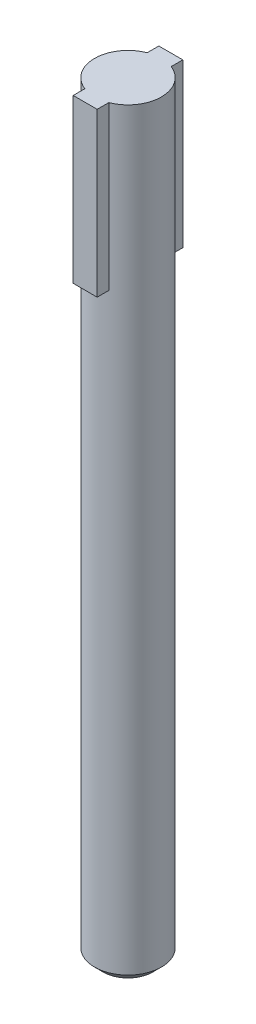
ISO-10303-21;
HEADER;
FILE_DESCRIPTION(('STEP AP214'),'2;1');
FILE_NAME('part.step','',(''),(''),'','','');
FILE_SCHEMA(('AUTOMOTIVE_DESIGN { 1 0 10303 214 1 1 1 1 }'));
ENDSEC;
DATA;
#1=APPLICATION_CONTEXT('core data for automotive mechanical design processes');
#2=APPLICATION_PROTOCOL_DEFINITION('international standard','automotive_design',2000,#1);
#3=PRODUCT_CONTEXT('',#1,'mechanical');
#4=PRODUCT('Part','Part','',(#3));
#5=PRODUCT_RELATED_PRODUCT_CATEGORY('part','',(#4));
#6=PRODUCT_DEFINITION_FORMATION('','',#4);
#7=PRODUCT_DEFINITION_CONTEXT('part definition',#1,'design');
#8=PRODUCT_DEFINITION('design','',#6,#7);
#9=PRODUCT_DEFINITION_SHAPE('','',#8);
#10=(LENGTH_UNIT() NAMED_UNIT(*) SI_UNIT(.MILLI.,.METRE.));
#11=(NAMED_UNIT(*) PLANE_ANGLE_UNIT() SI_UNIT($,.RADIAN.));
#12=(NAMED_UNIT(*) SI_UNIT($,.STERADIAN.) SOLID_ANGLE_UNIT());
#13=UNCERTAINTY_MEASURE_WITH_UNIT(LENGTH_MEASURE(1.E-05),#10,'distance_accuracy_value','');
#14=(GEOMETRIC_REPRESENTATION_CONTEXT(3) GLOBAL_UNCERTAINTY_ASSIGNED_CONTEXT((#13)) GLOBAL_UNIT_ASSIGNED_CONTEXT((#10,
#11,#12)) REPRESENTATION_CONTEXT('',''));
#15=CARTESIAN_POINT('',(0.,0.,0.));
#16=DIRECTION('',(0.,0.,1.));
#17=DIRECTION('',(1.,0.,0.));
#18=AXIS2_PLACEMENT_3D('',#15,#16,#17);
#19=CARTESIAN_POINT('',(0.,-81.,0.));
#20=DIRECTION('',(0.,1.,0.));
#21=DIRECTION('',(0.,0.,1.));
#22=AXIS2_PLACEMENT_3D('',#19,#20,#21);
#23=CYLINDRICAL_SURFACE('',#22,3.9);
#24=CARTESIAN_POINT('',(0.,-80.,0.));
#25=DIRECTION('',(0.,1.,0.));
#26=DIRECTION('',(0.,0.,1.));
#27=AXIS2_PLACEMENT_3D('',#24,#25,#26);
#28=CIRCLE('',#27,3.9);
#29=CARTESIAN_POINT('',(0.,-80.,3.9));
#30=VERTEX_POINT('',#29);
#31=EDGE_CURVE('E55',#30,#30,#28,.T.);
#32=ORIENTED_EDGE('',*,*,#31,.T.);
#33=EDGE_LOOP('',(#32));
#34=FACE_BOUND('',#33,.T.);
#35=CARTESIAN_POINT('',(0.,-11.,0.));
#36=DIRECTION('',(0.,1.,0.));
#37=DIRECTION('',(0.,0.,1.));
#38=AXIS2_PLACEMENT_3D('',#35,#36,#37);
#39=CIRCLE('',#38,3.9);
#40=CARTESIAN_POINT('',(-1.4,-11.,-3.64005494464026));
#41=VERTEX_POINT('',#40);
#42=CARTESIAN_POINT('',(1.4,-11.,-3.64005494464026));
#43=VERTEX_POINT('',#42);
#44=EDGE_CURVE('E192',#41,#43,#39,.F.);
#45=ORIENTED_EDGE('',*,*,#44,.T.);
#46=DIRECTION('',(0.,1.,0.));
#47=VECTOR('',#46,1.);
#48=CARTESIAN_POINT('',(1.4,-81.,-3.64005494464026));
#49=LINE('',#48,#47);
#50=CARTESIAN_POINT('',(1.4,8.,-3.64005494464026));
#51=VERTEX_POINT('',#50);
#52=EDGE_CURVE('E130',#43,#51,#49,.T.);
#53=ORIENTED_EDGE('',*,*,#52,.T.);
#54=CARTESIAN_POINT('',(0.,8.,0.));
#55=DIRECTION('',(0.,1.,0.));
#56=DIRECTION('',(0.,0.,1.));
#57=AXIS2_PLACEMENT_3D('',#54,#55,#56);
#58=CIRCLE('',#57,3.9);
#59=CARTESIAN_POINT('',(1.4,8.,3.64005494464026));
#60=VERTEX_POINT('',#59);
#61=EDGE_CURVE('E186',#60,#51,#58,.T.);
#62=ORIENTED_EDGE('',*,*,#61,.F.);
#63=DIRECTION('',(0.,1.,0.));
#64=VECTOR('',#63,1.);
#65=CARTESIAN_POINT('',(1.4,-81.,3.64005494464026));
#66=LINE('',#65,#64);
#67=CARTESIAN_POINT('',(1.4,-11.,3.64005494464026));
#68=VERTEX_POINT('',#67);
#69=EDGE_CURVE('E181',#60,#68,#66,.F.);
#70=ORIENTED_EDGE('',*,*,#69,.T.);
#71=CARTESIAN_POINT('',(-1.4,-11.,3.64005494464026));
#72=VERTEX_POINT('',#71);
#73=EDGE_CURVE('E189',#68,#72,#39,.F.);
#74=ORIENTED_EDGE('',*,*,#73,.T.);
#75=DIRECTION('',(0.,1.,0.));
#76=VECTOR('',#75,1.);
#77=CARTESIAN_POINT('',(-1.4,-81.,3.64005494464026));
#78=LINE('',#77,#76);
#79=CARTESIAN_POINT('',(-1.4,8.,3.64005494464026));
#80=VERTEX_POINT('',#79);
#81=EDGE_CURVE('E165',#72,#80,#78,.T.);
#82=ORIENTED_EDGE('',*,*,#81,.T.);
#83=CARTESIAN_POINT('',(-1.4,8.,-3.64005494464026));
#84=VERTEX_POINT('',#83);
#85=EDGE_CURVE('E185',#84,#80,#58,.T.);
#86=ORIENTED_EDGE('',*,*,#85,.F.);
#87=DIRECTION('',(0.,1.,0.));
#88=VECTOR('',#87,1.);
#89=CARTESIAN_POINT('',(-1.4,-81.,-3.64005494464026));
#90=LINE('',#89,#88);
#91=EDGE_CURVE('E175',#84,#41,#90,.F.);
#92=ORIENTED_EDGE('',*,*,#91,.T.);
#93=EDGE_LOOP('',(#45,#53,#62,#70,#74,#82,#86,#92));
#94=FACE_BOUND('',#93,.T.);
#95=ADVANCED_FACE('F45',(#34,#94),#23,.T.);
#96=CARTESIAN_POINT('',(0.,-81.,0.));
#97=DIRECTION('',(0.,1.,0.));
#98=DIRECTION('',(0.,0.,1.));
#99=AXIS2_PLACEMENT_3D('',#96,#97,#98);
#100=PLANE('',#99);
#101=CARTESIAN_POINT('',(0.,-81.,0.));
#102=DIRECTION('',(0.,1.,0.));
#103=DIRECTION('',(0.,0.,1.));
#104=AXIS2_PLACEMENT_3D('',#101,#102,#103);
#105=CIRCLE('',#104,2.89999999999999);
#106=CARTESIAN_POINT('',(0.,-81.,2.89999999999999));
#107=VERTEX_POINT('',#106);
#108=EDGE_CURVE('E11',#107,#107,#105,.F.);
#109=ORIENTED_EDGE('',*,*,#108,.T.);
#110=EDGE_LOOP('',(#109));
#111=FACE_BOUND('',#110,.T.);
#112=ADVANCED_FACE('F234',(#111),#100,.F.);
#113=CARTESIAN_POINT('',(0.,8.,0.));
#114=DIRECTION('',(0.,1.,0.));
#115=DIRECTION('',(0.,0.,1.));
#116=AXIS2_PLACEMENT_3D('',#113,#114,#115);
#117=PLANE('',#116);
#118=ORIENTED_EDGE('',*,*,#85,.T.);
#119=DIRECTION('',(0.,0.,-1.));
#120=VECTOR('',#119,1.);
#121=CARTESIAN_POINT('',(-1.4,8.,0.));
#122=LINE('',#121,#120);
#123=CARTESIAN_POINT('',(-1.4,8.,5.));
#124=VERTEX_POINT('',#123);
#125=EDGE_CURVE('E155',#124,#80,#122,.T.);
#126=ORIENTED_EDGE('',*,*,#125,.F.);
#127=DIRECTION('',(-1.,0.,0.));
#128=VECTOR('',#127,1.);
#129=CARTESIAN_POINT('',(0.,8.,5.));
#130=LINE('',#129,#128);
#131=CARTESIAN_POINT('',(1.4,8.,5.));
#132=VERTEX_POINT('',#131);
#133=EDGE_CURVE('E158',#132,#124,#130,.T.);
#134=ORIENTED_EDGE('',*,*,#133,.F.);
#135=DIRECTION('',(0.,0.,1.));
#136=VECTOR('',#135,1.);
#137=CARTESIAN_POINT('',(1.4,8.,0.));
#138=LINE('',#137,#136);
#139=EDGE_CURVE('E69',#60,#132,#138,.T.);
#140=ORIENTED_EDGE('',*,*,#139,.F.);
#141=ORIENTED_EDGE('',*,*,#61,.T.);
#142=CARTESIAN_POINT('',(1.4,8.,-5.));
#143=VERTEX_POINT('',#142);
#144=EDGE_CURVE('E150',#143,#51,#138,.T.);
#145=ORIENTED_EDGE('',*,*,#144,.F.);
#146=DIRECTION('',(-1.,0.,0.));
#147=VECTOR('',#146,1.);
#148=CARTESIAN_POINT('',(0.,8.,-5.));
#149=LINE('',#148,#147);
#150=CARTESIAN_POINT('',(-1.4,8.,-5.));
#151=VERTEX_POINT('',#150);
#152=EDGE_CURVE('E119',#143,#151,#149,.T.);
#153=ORIENTED_EDGE('',*,*,#152,.T.);
#154=EDGE_CURVE('E62',#84,#151,#122,.T.);
#155=ORIENTED_EDGE('',*,*,#154,.F.);
#156=EDGE_LOOP('',(#118,#126,#134,#140,#141,#145,#153,#155));
#157=FACE_BOUND('',#156,.T.);
#158=ADVANCED_FACE('F203',(#157),#117,.T.);
#159=CARTESIAN_POINT('',(0.,-11.,5.));
#160=DIRECTION('',(0.,0.,-1.));
#161=DIRECTION('',(-1.,0.,0.));
#162=AXIS2_PLACEMENT_3D('',#159,#160,#161);
#163=PLANE('',#162);
#164=ORIENTED_EDGE('',*,*,#133,.T.);
#165=DIRECTION('',(0.,1.,0.));
#166=VECTOR('',#165,1.);
#167=CARTESIAN_POINT('',(-1.4,-11.,5.));
#168=LINE('',#167,#166);
#169=CARTESIAN_POINT('',(-1.4,-11.,5.));
#170=VERTEX_POINT('',#169);
#171=EDGE_CURVE('E166',#170,#124,#168,.T.);
#172=ORIENTED_EDGE('',*,*,#171,.F.);
#173=DIRECTION('',(-1.,0.,0.));
#174=VECTOR('',#173,1.);
#175=CARTESIAN_POINT('',(0.,-11.,5.));
#176=LINE('',#175,#174);
#177=CARTESIAN_POINT('',(1.4,-11.,5.));
#178=VERTEX_POINT('',#177);
#179=EDGE_CURVE('E124',#178,#170,#176,.T.);
#180=ORIENTED_EDGE('',*,*,#179,.F.);
#181=DIRECTION('',(0.,1.,0.));
#182=VECTOR('',#181,1.);
#183=CARTESIAN_POINT('',(1.4,-11.,5.));
#184=LINE('',#183,#182);
#185=EDGE_CURVE('E161',#178,#132,#184,.T.);
#186=ORIENTED_EDGE('',*,*,#185,.T.);
#187=EDGE_LOOP('',(#164,#172,#180,#186));
#188=FACE_BOUND('',#187,.T.);
#189=ADVANCED_FACE('F216',(#188),#163,.F.);
#190=CARTESIAN_POINT('',(0.,-11.,0.));
#191=DIRECTION('',(0.,1.,0.));
#192=DIRECTION('',(0.,0.,1.));
#193=AXIS2_PLACEMENT_3D('',#190,#191,#192);
#194=PLANE('',#193);
#195=ORIENTED_EDGE('',*,*,#73,.F.);
#196=DIRECTION('',(0.,0.,1.));
#197=VECTOR('',#196,1.);
#198=CARTESIAN_POINT('',(1.4,-11.,0.));
#199=LINE('',#198,#197);
#200=EDGE_CURVE('E134',#68,#178,#199,.T.);
#201=ORIENTED_EDGE('',*,*,#200,.T.);
#202=ORIENTED_EDGE('',*,*,#179,.T.);
#203=DIRECTION('',(0.,0.,-1.));
#204=VECTOR('',#203,1.);
#205=CARTESIAN_POINT('',(-1.4,-11.,0.));
#206=LINE('',#205,#204);
#207=EDGE_CURVE('E143',#170,#72,#206,.T.);
#208=ORIENTED_EDGE('',*,*,#207,.T.);
#209=EDGE_LOOP('',(#195,#201,#202,#208));
#210=FACE_BOUND('',#209,.T.);
#211=ADVANCED_FACE('F213',(#210),#194,.F.);
#212=CARTESIAN_POINT('',(-1.4,-11.,0.));
#213=DIRECTION('',(1.,0.,0.));
#214=DIRECTION('',(0.,0.,-1.));
#215=AXIS2_PLACEMENT_3D('',#212,#213,#214);
#216=PLANE('',#215);
#217=ORIENTED_EDGE('',*,*,#81,.F.);
#218=ORIENTED_EDGE('',*,*,#207,.F.);
#219=ORIENTED_EDGE('',*,*,#171,.T.);
#220=ORIENTED_EDGE('',*,*,#125,.T.);
#221=EDGE_LOOP('',(#217,#218,#219,#220));
#222=FACE_BOUND('',#221,.T.);
#223=ADVANCED_FACE('F220',(#222),#216,.F.);
#224=CARTESIAN_POINT('',(1.4,-11.,0.));
#225=DIRECTION('',(-1.,0.,0.));
#226=DIRECTION('',(0.,0.,1.));
#227=AXIS2_PLACEMENT_3D('',#224,#225,#226);
#228=PLANE('',#227);
#229=ORIENTED_EDGE('',*,*,#69,.F.);
#230=ORIENTED_EDGE('',*,*,#139,.T.);
#231=ORIENTED_EDGE('',*,*,#185,.F.);
#232=ORIENTED_EDGE('',*,*,#200,.F.);
#233=EDGE_LOOP('',(#229,#230,#231,#232));
#234=FACE_BOUND('',#233,.T.);
#235=ADVANCED_FACE('F206',(#234),#228,.F.);
#236=ORIENTED_EDGE('',*,*,#44,.F.);
#237=CARTESIAN_POINT('',(-1.4,-11.,-5.));
#238=VERTEX_POINT('',#237);
#239=EDGE_CURVE('E138',#41,#238,#206,.T.);
#240=ORIENTED_EDGE('',*,*,#239,.T.);
#241=DIRECTION('',(-1.,0.,0.));
#242=VECTOR('',#241,1.);
#243=CARTESIAN_POINT('',(0.,-11.,-5.));
#244=LINE('',#243,#242);
#245=CARTESIAN_POINT('',(1.4,-11.,-5.));
#246=VERTEX_POINT('',#245);
#247=EDGE_CURVE('E118',#246,#238,#244,.T.);
#248=ORIENTED_EDGE('',*,*,#247,.F.);
#249=EDGE_CURVE('E127',#246,#43,#199,.T.);
#250=ORIENTED_EDGE('',*,*,#249,.T.);
#251=EDGE_LOOP('',(#236,#240,#248,#250));
#252=FACE_BOUND('',#251,.T.);
#253=ADVANCED_FACE('F136',(#252),#194,.F.);
#254=ORIENTED_EDGE('',*,*,#91,.F.);
#255=ORIENTED_EDGE('',*,*,#154,.T.);
#256=DIRECTION('',(0.,1.,0.));
#257=VECTOR('',#256,1.);
#258=CARTESIAN_POINT('',(-1.4,-11.,-5.));
#259=LINE('',#258,#257);
#260=EDGE_CURVE('E123',#238,#151,#259,.T.);
#261=ORIENTED_EDGE('',*,*,#260,.F.);
#262=ORIENTED_EDGE('',*,*,#239,.F.);
#263=EDGE_LOOP('',(#254,#255,#261,#262));
#264=FACE_BOUND('',#263,.T.);
#265=ADVANCED_FACE('F202',(#264),#216,.F.);
#266=ORIENTED_EDGE('',*,*,#52,.F.);
#267=ORIENTED_EDGE('',*,*,#249,.F.);
#268=DIRECTION('',(0.,1.,0.));
#269=VECTOR('',#268,1.);
#270=CARTESIAN_POINT('',(1.4,-11.,-5.));
#271=LINE('',#270,#269);
#272=EDGE_CURVE('E113',#246,#143,#271,.T.);
#273=ORIENTED_EDGE('',*,*,#272,.T.);
#274=ORIENTED_EDGE('',*,*,#144,.T.);
#275=EDGE_LOOP('',(#266,#267,#273,#274));
#276=FACE_BOUND('',#275,.T.);
#277=ADVANCED_FACE('F128',(#276),#228,.F.);
#278=CARTESIAN_POINT('',(0.,-11.,-5.));
#279=DIRECTION('',(0.,0.,-1.));
#280=DIRECTION('',(-1.,0.,0.));
#281=AXIS2_PLACEMENT_3D('',#278,#279,#280);
#282=PLANE('',#281);
#283=ORIENTED_EDGE('',*,*,#152,.F.);
#284=ORIENTED_EDGE('',*,*,#272,.F.);
#285=ORIENTED_EDGE('',*,*,#247,.T.);
#286=ORIENTED_EDGE('',*,*,#260,.T.);
#287=EDGE_LOOP('',(#283,#284,#285,#286));
#288=FACE_BOUND('',#287,.T.);
#289=ADVANCED_FACE('F115',(#288),#282,.T.);
#290=CARTESIAN_POINT('',(0.,-80.,0.));
#291=DIRECTION('',(0.,1.,0.));
#292=DIRECTION('',(0.,0.,1.));
#293=AXIS2_PLACEMENT_3D('',#290,#291,#292);
#294=CONICAL_SURFACE('',#293,3.9,0.785398163397448);
#295=ORIENTED_EDGE('',*,*,#108,.F.);
#296=EDGE_LOOP('',(#295));
#297=FACE_BOUND('',#296,.T.);
#298=ORIENTED_EDGE('',*,*,#31,.F.);
#299=EDGE_LOOP('',(#298));
#300=FACE_BOUND('',#299,.T.);
#301=ADVANCED_FACE('F48',(#297,#300),#294,.T.);
#302=CLOSED_SHELL('',(#95,#112,#158,#189,#211,#223,#235,#253,#265,#277,#289,#301));
#303=MANIFOLD_SOLID_BREP('B2',#302);
#304=ADVANCED_BREP_SHAPE_REPRESENTATION('',(#18,#303),#14);
#305=SHAPE_DEFINITION_REPRESENTATION(#9,#304);
ENDSEC;
END-ISO-10303-21;
